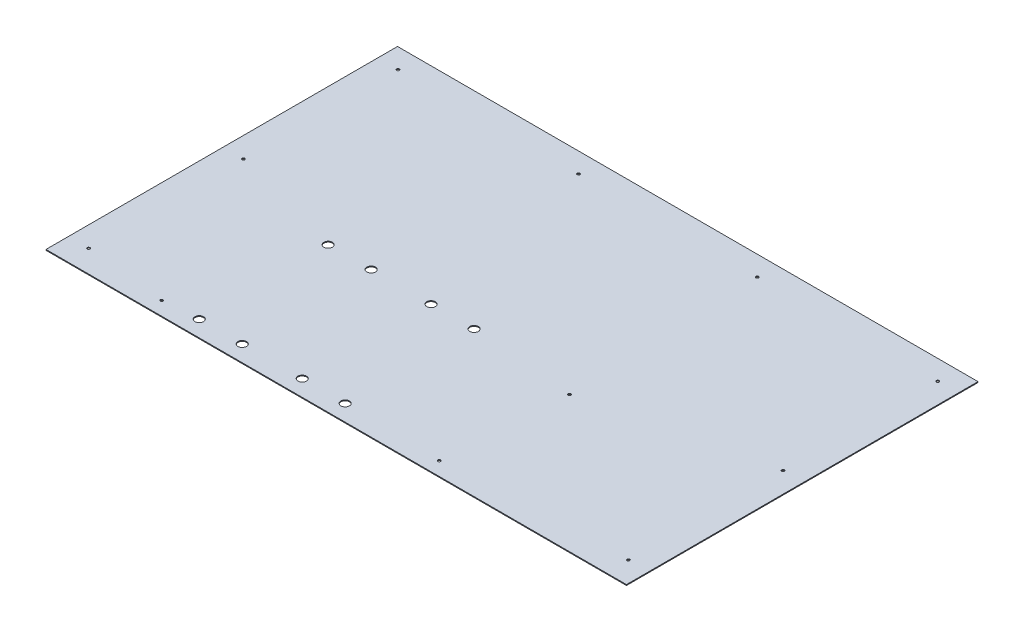
ISO-10303-21;
HEADER;
FILE_DESCRIPTION(('STEP AP214'),'2;1');
FILE_NAME('part.step','',(''),(''),'','','');
FILE_SCHEMA(('AUTOMOTIVE_DESIGN { 1 0 10303 214 1 1 1 1 }'));
ENDSEC;
DATA;
#1=APPLICATION_CONTEXT('core data for automotive mechanical design processes');
#2=APPLICATION_PROTOCOL_DEFINITION('international standard','automotive_design',2000,#1);
#3=PRODUCT_CONTEXT('',#1,'mechanical');
#4=PRODUCT('Part','Part','',(#3));
#5=PRODUCT_RELATED_PRODUCT_CATEGORY('part','',(#4));
#6=PRODUCT_DEFINITION_FORMATION('','',#4);
#7=PRODUCT_DEFINITION_CONTEXT('part definition',#1,'design');
#8=PRODUCT_DEFINITION('design','',#6,#7);
#9=PRODUCT_DEFINITION_SHAPE('','',#8);
#10=(LENGTH_UNIT() NAMED_UNIT(*) SI_UNIT(.MILLI.,.METRE.));
#11=(NAMED_UNIT(*) PLANE_ANGLE_UNIT() SI_UNIT($,.RADIAN.));
#12=(NAMED_UNIT(*) SI_UNIT($,.STERADIAN.) SOLID_ANGLE_UNIT());
#13=UNCERTAINTY_MEASURE_WITH_UNIT(LENGTH_MEASURE(1.E-05),#10,'distance_accuracy_value','');
#14=(GEOMETRIC_REPRESENTATION_CONTEXT(3) GLOBAL_UNCERTAINTY_ASSIGNED_CONTEXT((#13)) GLOBAL_UNIT_ASSIGNED_CONTEXT((#10,
#11,#12)) REPRESENTATION_CONTEXT('',''));
#15=CARTESIAN_POINT('',(0.,0.,0.));
#16=DIRECTION('',(0.,0.,1.));
#17=DIRECTION('',(1.,0.,0.));
#18=AXIS2_PLACEMENT_3D('',#15,#16,#17);
#19=CARTESIAN_POINT('',(337.7,1.,204.5));
#20=DIRECTION('',(-1.,0.,0.));
#21=DIRECTION('',(0.,0.,1.));
#22=AXIS2_PLACEMENT_3D('',#19,#20,#21);
#23=PLANE('',#22);
#24=DIRECTION('',(0.,0.,-1.));
#25=VECTOR('',#24,1.);
#26=CARTESIAN_POINT('',(337.7,0.,204.5));
#27=LINE('',#26,#25);
#28=CARTESIAN_POINT('',(337.7,0.,204.5));
#29=VERTEX_POINT('',#28);
#30=CARTESIAN_POINT('',(337.7,0.,-204.5));
#31=VERTEX_POINT('',#30);
#32=EDGE_CURVE('E95',#29,#31,#27,.T.);
#33=ORIENTED_EDGE('',*,*,#32,.T.);
#34=DIRECTION('',(0.,-1.,0.));
#35=VECTOR('',#34,1.);
#36=CARTESIAN_POINT('',(337.7,1.,-204.5));
#37=LINE('',#36,#35);
#38=CARTESIAN_POINT('',(337.7,1.,-204.5));
#39=VERTEX_POINT('',#38);
#40=EDGE_CURVE('E11',#39,#31,#37,.T.);
#41=ORIENTED_EDGE('',*,*,#40,.F.);
#42=DIRECTION('',(0.,0.,-1.));
#43=VECTOR('',#42,1.);
#44=CARTESIAN_POINT('',(337.7,1.,204.5));
#45=LINE('',#44,#43);
#46=CARTESIAN_POINT('',(337.7,1.,204.5));
#47=VERTEX_POINT('',#46);
#48=EDGE_CURVE('E83',#47,#39,#45,.T.);
#49=ORIENTED_EDGE('',*,*,#48,.F.);
#50=DIRECTION('',(0.,-1.,0.));
#51=VECTOR('',#50,1.);
#52=CARTESIAN_POINT('',(337.7,1.,204.5));
#53=LINE('',#52,#51);
#54=EDGE_CURVE('E91',#47,#29,#53,.T.);
#55=ORIENTED_EDGE('',*,*,#54,.T.);
#56=EDGE_LOOP('',(#33,#41,#49,#55));
#57=FACE_BOUND('',#56,.T.);
#58=ADVANCED_FACE('F32',(#57),#23,.F.);
#59=CARTESIAN_POINT('',(-337.7,1.,-204.5));
#60=DIRECTION('',(0.,0.,1.));
#61=DIRECTION('',(1.,0.,0.));
#62=AXIS2_PLACEMENT_3D('',#59,#60,#61);
#63=PLANE('',#62);
#64=DIRECTION('',(-1.,0.,0.));
#65=VECTOR('',#64,1.);
#66=CARTESIAN_POINT('',(-337.7,0.,-204.5));
#67=LINE('',#66,#65);
#68=CARTESIAN_POINT('',(-337.7,0.,-204.5));
#69=VERTEX_POINT('',#68);
#70=EDGE_CURVE('E87',#31,#69,#67,.T.);
#71=ORIENTED_EDGE('',*,*,#70,.T.);
#72=DIRECTION('',(0.,-1.,0.));
#73=VECTOR('',#72,1.);
#74=CARTESIAN_POINT('',(-337.7,1.,-204.5));
#75=LINE('',#74,#73);
#76=CARTESIAN_POINT('',(-337.7,1.,-204.5));
#77=VERTEX_POINT('',#76);
#78=EDGE_CURVE('E40',#77,#69,#75,.T.);
#79=ORIENTED_EDGE('',*,*,#78,.F.);
#80=DIRECTION('',(-1.,0.,0.));
#81=VECTOR('',#80,1.);
#82=CARTESIAN_POINT('',(-337.7,1.,-204.5));
#83=LINE('',#82,#81);
#84=EDGE_CURVE('E78',#39,#77,#83,.T.);
#85=ORIENTED_EDGE('',*,*,#84,.F.);
#86=ORIENTED_EDGE('',*,*,#40,.T.);
#87=EDGE_LOOP('',(#71,#79,#85,#86));
#88=FACE_BOUND('',#87,.T.);
#89=ADVANCED_FACE('F86',(#88),#63,.F.);
#90=CARTESIAN_POINT('',(-337.7,1.,204.5));
#91=DIRECTION('',(1.,0.,0.));
#92=DIRECTION('',(0.,0.,-1.));
#93=AXIS2_PLACEMENT_3D('',#90,#91,#92);
#94=PLANE('',#93);
#95=DIRECTION('',(0.,0.,1.));
#96=VECTOR('',#95,1.);
#97=CARTESIAN_POINT('',(-337.7,0.,204.5));
#98=LINE('',#97,#96);
#99=CARTESIAN_POINT('',(-337.7,0.,204.5));
#100=VERTEX_POINT('',#99);
#101=EDGE_CURVE('E65',#69,#100,#98,.T.);
#102=ORIENTED_EDGE('',*,*,#101,.T.);
#103=DIRECTION('',(0.,-1.,0.));
#104=VECTOR('',#103,1.);
#105=CARTESIAN_POINT('',(-337.7,1.,204.5));
#106=LINE('',#105,#104);
#107=CARTESIAN_POINT('',(-337.7,1.,204.5));
#108=VERTEX_POINT('',#107);
#109=EDGE_CURVE('E88',#108,#100,#106,.T.);
#110=ORIENTED_EDGE('',*,*,#109,.F.);
#111=DIRECTION('',(0.,0.,1.));
#112=VECTOR('',#111,1.);
#113=CARTESIAN_POINT('',(-337.7,1.,204.5));
#114=LINE('',#113,#112);
#115=EDGE_CURVE('E81',#77,#108,#114,.T.);
#116=ORIENTED_EDGE('',*,*,#115,.F.);
#117=ORIENTED_EDGE('',*,*,#78,.T.);
#118=EDGE_LOOP('',(#102,#110,#116,#117));
#119=FACE_BOUND('',#118,.T.);
#120=ADVANCED_FACE('F89',(#119),#94,.F.);
#121=CARTESIAN_POINT('',(-337.7,1.,204.5));
#122=DIRECTION('',(0.,0.,-1.));
#123=DIRECTION('',(-1.,0.,0.));
#124=AXIS2_PLACEMENT_3D('',#121,#122,#123);
#125=PLANE('',#124);
#126=DIRECTION('',(1.,0.,0.));
#127=VECTOR('',#126,1.);
#128=CARTESIAN_POINT('',(-337.7,0.,204.5));
#129=LINE('',#128,#127);
#130=EDGE_CURVE('E71',#100,#29,#129,.T.);
#131=ORIENTED_EDGE('',*,*,#130,.T.);
#132=ORIENTED_EDGE('',*,*,#54,.F.);
#133=DIRECTION('',(1.,0.,0.));
#134=VECTOR('',#133,1.);
#135=CARTESIAN_POINT('',(-337.7,1.,204.5));
#136=LINE('',#135,#134);
#137=EDGE_CURVE('E48',#108,#47,#136,.T.);
#138=ORIENTED_EDGE('',*,*,#137,.F.);
#139=ORIENTED_EDGE('',*,*,#109,.T.);
#140=EDGE_LOOP('',(#131,#132,#138,#139));
#141=FACE_BOUND('',#140,.T.);
#142=ADVANCED_FACE('F103',(#141),#125,.F.);
#143=CARTESIAN_POINT('',(0.,1.,0.));
#144=DIRECTION('',(0.,-1.,0.));
#145=DIRECTION('',(0.,0.,-1.));
#146=AXIS2_PLACEMENT_3D('',#143,#144,#145);
#147=PLANE('',#146);
#148=CARTESIAN_POINT('',(-104.,1.,-181.4));
#149=DIRECTION('',(0.,-1.,0.));
#150=DIRECTION('',(0.,0.,-1.));
#151=AXIS2_PLACEMENT_3D('',#148,#149,#150);
#152=CIRCLE('',#151,1.59999999999996);
#153=CARTESIAN_POINT('',(-104.,1.,-183.));
#154=VERTEX_POINT('',#153);
#155=EDGE_CURVE('E216',#154,#154,#152,.F.);
#156=ORIENTED_EDGE('',*,*,#155,.F.);
#157=EDGE_LOOP('',(#156));
#158=FACE_BOUND('',#157,.T.);
#159=CARTESIAN_POINT('',(104.,1.,188.6));
#160=DIRECTION('',(0.,-1.,0.));
#161=DIRECTION('',(0.,0.,-1.));
#162=AXIS2_PLACEMENT_3D('',#159,#160,#161);
#163=CIRCLE('',#162,1.60000000000002);
#164=CARTESIAN_POINT('',(104.,1.,187.));
#165=VERTEX_POINT('',#164);
#166=EDGE_CURVE('E210',#165,#165,#163,.F.);
#167=ORIENTED_EDGE('',*,*,#166,.F.);
#168=EDGE_LOOP('',(#167));
#169=FACE_BOUND('',#168,.T.);
#170=CARTESIAN_POINT('',(104.,1.,-181.4));
#171=DIRECTION('',(0.,-1.,0.));
#172=DIRECTION('',(0.,0.,-1.));
#173=AXIS2_PLACEMENT_3D('',#170,#171,#172);
#174=CIRCLE('',#173,1.59999999999999);
#175=CARTESIAN_POINT('',(104.,1.,-183.));
#176=VERTEX_POINT('',#175);
#177=EDGE_CURVE('E204',#176,#176,#174,.F.);
#178=ORIENTED_EDGE('',*,*,#177,.F.);
#179=EDGE_LOOP('',(#178));
#180=FACE_BOUND('',#179,.T.);
#181=CARTESIAN_POINT('',(-219.,1.,188.6));
#182=DIRECTION('',(0.,-1.,0.));
#183=DIRECTION('',(0.,0.,-1.));
#184=AXIS2_PLACEMENT_3D('',#181,#182,#183);
#185=CIRCLE('',#184,1.59999999999999);
#186=CARTESIAN_POINT('',(-219.,1.,187.));
#187=VERTEX_POINT('',#186);
#188=EDGE_CURVE('E198',#187,#187,#185,.F.);
#189=ORIENTED_EDGE('',*,*,#188,.F.);
#190=EDGE_LOOP('',(#189));
#191=FACE_BOUND('',#190,.T.);
#192=CARTESIAN_POINT('',(314.,1.,-1.3999999999999));
#193=DIRECTION('',(0.,-1.,0.));
#194=DIRECTION('',(0.,0.,-1.));
#195=AXIS2_PLACEMENT_3D('',#192,#193,#194);
#196=CIRCLE('',#195,1.59999999999996);
#197=CARTESIAN_POINT('',(314.,1.,-2.99999999999987));
#198=VERTEX_POINT('',#197);
#199=EDGE_CURVE('E192',#198,#198,#196,.F.);
#200=ORIENTED_EDGE('',*,*,#199,.F.);
#201=EDGE_LOOP('',(#200));
#202=FACE_BOUND('',#201,.T.);
#203=CARTESIAN_POINT('',(-314.,1.,-1.40000000000004));
#204=DIRECTION('',(0.,-1.,0.));
#205=DIRECTION('',(0.,0.,-1.));
#206=AXIS2_PLACEMENT_3D('',#203,#204,#205);
#207=CIRCLE('',#206,1.59999999999996);
#208=CARTESIAN_POINT('',(-314.,1.,-3.));
#209=VERTEX_POINT('',#208);
#210=EDGE_CURVE('E186',#209,#209,#207,.F.);
#211=ORIENTED_EDGE('',*,*,#210,.F.);
#212=EDGE_LOOP('',(#211));
#213=FACE_BOUND('',#212,.T.);
#214=CARTESIAN_POINT('',(-128.3,1.,35.6));
#215=DIRECTION('',(0.,-1.,0.));
#216=DIRECTION('',(0.,0.,-1.));
#217=AXIS2_PLACEMENT_3D('',#214,#215,#216);
#218=CIRCLE('',#217,4.99999999999999);
#219=CARTESIAN_POINT('',(-128.3,1.,30.6));
#220=VERTEX_POINT('',#219);
#221=EDGE_CURVE('E180',#220,#220,#218,.F.);
#222=ORIENTED_EDGE('',*,*,#221,.F.);
#223=EDGE_LOOP('',(#222));
#224=FACE_BOUND('',#223,.T.);
#225=CARTESIAN_POINT('',(-178.3,1.,35.6));
#226=DIRECTION('',(0.,-1.,0.));
#227=DIRECTION('',(0.,0.,-1.));
#228=AXIS2_PLACEMENT_3D('',#225,#226,#227);
#229=CIRCLE('',#228,4.99999999999999);
#230=CARTESIAN_POINT('',(-178.3,1.,30.6));
#231=VERTEX_POINT('',#230);
#232=EDGE_CURVE('E174',#231,#231,#229,.F.);
#233=ORIENTED_EDGE('',*,*,#232,.F.);
#234=EDGE_LOOP('',(#233));
#235=FACE_BOUND('',#234,.T.);
#236=CARTESIAN_POINT('',(-178.3,1.,185.6));
#237=DIRECTION('',(0.,-1.,0.));
#238=DIRECTION('',(0.,0.,-1.));
#239=AXIS2_PLACEMENT_3D('',#236,#237,#238);
#240=CIRCLE('',#239,4.99999999999999);
#241=CARTESIAN_POINT('',(-178.3,1.,180.6));
#242=VERTEX_POINT('',#241);
#243=EDGE_CURVE('E168',#242,#242,#240,.F.);
#244=ORIENTED_EDGE('',*,*,#243,.F.);
#245=EDGE_LOOP('',(#244));
#246=FACE_BOUND('',#245,.T.);
#247=CARTESIAN_POINT('',(-128.3,1.,185.6));
#248=DIRECTION('',(0.,-1.,0.));
#249=DIRECTION('',(0.,0.,-1.));
#250=AXIS2_PLACEMENT_3D('',#247,#248,#249);
#251=CIRCLE('',#250,5.00000000000002);
#252=CARTESIAN_POINT('',(-128.3,1.,180.6));
#253=VERTEX_POINT('',#252);
#254=EDGE_CURVE('E162',#253,#253,#251,.F.);
#255=ORIENTED_EDGE('',*,*,#254,.F.);
#256=EDGE_LOOP('',(#255));
#257=FACE_BOUND('',#256,.T.);
#258=CARTESIAN_POINT('',(-58.5,1.,185.6));
#259=DIRECTION('',(0.,-1.,0.));
#260=DIRECTION('',(0.,0.,-1.));
#261=AXIS2_PLACEMENT_3D('',#258,#259,#260);
#262=CIRCLE('',#261,5.00000000000002);
#263=CARTESIAN_POINT('',(-58.5,1.,180.6));
#264=VERTEX_POINT('',#263);
#265=EDGE_CURVE('E156',#264,#264,#262,.F.);
#266=ORIENTED_EDGE('',*,*,#265,.F.);
#267=EDGE_LOOP('',(#266));
#268=FACE_BOUND('',#267,.T.);
#269=CARTESIAN_POINT('',(-8.49999999999999,1.,185.6));
#270=DIRECTION('',(0.,-1.,0.));
#271=DIRECTION('',(0.,0.,-1.));
#272=AXIS2_PLACEMENT_3D('',#269,#270,#271);
#273=CIRCLE('',#272,5.00000000000001);
#274=CARTESIAN_POINT('',(-8.49999999999999,1.,180.6));
#275=VERTEX_POINT('',#274);
#276=EDGE_CURVE('E150',#275,#275,#273,.F.);
#277=ORIENTED_EDGE('',*,*,#276,.F.);
#278=EDGE_LOOP('',(#277));
#279=FACE_BOUND('',#278,.T.);
#280=CARTESIAN_POINT('',(-8.49999999999999,1.,35.6));
#281=DIRECTION('',(0.,-1.,0.));
#282=DIRECTION('',(0.,0.,-1.));
#283=AXIS2_PLACEMENT_3D('',#280,#281,#282);
#284=CIRCLE('',#283,4.99999999999999);
#285=CARTESIAN_POINT('',(-8.49999999999999,1.,30.6));
#286=VERTEX_POINT('',#285);
#287=EDGE_CURVE('E144',#286,#286,#284,.F.);
#288=ORIENTED_EDGE('',*,*,#287,.F.);
#289=EDGE_LOOP('',(#288));
#290=FACE_BOUND('',#289,.T.);
#291=CARTESIAN_POINT('',(-58.5,1.,35.6));
#292=DIRECTION('',(0.,-1.,0.));
#293=DIRECTION('',(0.,0.,-1.));
#294=AXIS2_PLACEMENT_3D('',#291,#292,#293);
#295=CIRCLE('',#294,4.99999999999999);
#296=CARTESIAN_POINT('',(-58.5,1.,30.6));
#297=VERTEX_POINT('',#296);
#298=EDGE_CURVE('E138',#297,#297,#295,.F.);
#299=ORIENTED_EDGE('',*,*,#298,.F.);
#300=EDGE_LOOP('',(#299));
#301=FACE_BOUND('',#300,.T.);
#302=CARTESIAN_POINT('',(113.,1.,46.25));
#303=DIRECTION('',(0.,-1.,0.));
#304=DIRECTION('',(0.,0.,-1.));
#305=AXIS2_PLACEMENT_3D('',#302,#303,#304);
#306=CIRCLE('',#305,1.60000000000001);
#307=CARTESIAN_POINT('',(113.,1.,44.65));
#308=VERTEX_POINT('',#307);
#309=EDGE_CURVE('E132',#308,#308,#306,.F.);
#310=ORIENTED_EDGE('',*,*,#309,.F.);
#311=EDGE_LOOP('',(#310));
#312=FACE_BOUND('',#311,.T.);
#313=CARTESIAN_POINT('',(314.,1.,178.6));
#314=DIRECTION('',(0.,-1.,0.));
#315=DIRECTION('',(0.,0.,-1.));
#316=AXIS2_PLACEMENT_3D('',#313,#314,#315);
#317=CIRCLE('',#316,1.59999999999996);
#318=CARTESIAN_POINT('',(314.,1.,177.));
#319=VERTEX_POINT('',#318);
#320=EDGE_CURVE('E126',#319,#319,#317,.F.);
#321=ORIENTED_EDGE('',*,*,#320,.F.);
#322=EDGE_LOOP('',(#321));
#323=FACE_BOUND('',#322,.T.);
#324=CARTESIAN_POINT('',(314.,1.,-181.4));
#325=DIRECTION('',(0.,-1.,0.));
#326=DIRECTION('',(0.,0.,-1.));
#327=AXIS2_PLACEMENT_3D('',#324,#325,#326);
#328=CIRCLE('',#327,1.59999999999996);
#329=CARTESIAN_POINT('',(314.,1.,-183.));
#330=VERTEX_POINT('',#329);
#331=EDGE_CURVE('E120',#330,#330,#328,.F.);
#332=ORIENTED_EDGE('',*,*,#331,.F.);
#333=EDGE_LOOP('',(#332));
#334=FACE_BOUND('',#333,.T.);
#335=CARTESIAN_POINT('',(-314.,1.,-181.4));
#336=DIRECTION('',(0.,-1.,0.));
#337=DIRECTION('',(0.,0.,-1.));
#338=AXIS2_PLACEMENT_3D('',#335,#336,#337);
#339=CIRCLE('',#338,1.59999999999996);
#340=CARTESIAN_POINT('',(-314.,1.,-183.));
#341=VERTEX_POINT('',#340);
#342=EDGE_CURVE('E114',#341,#341,#339,.F.);
#343=ORIENTED_EDGE('',*,*,#342,.F.);
#344=EDGE_LOOP('',(#343));
#345=FACE_BOUND('',#344,.T.);
#346=CARTESIAN_POINT('',(-314.,1.,178.6));
#347=DIRECTION('',(0.,-1.,0.));
#348=DIRECTION('',(0.,0.,-1.));
#349=AXIS2_PLACEMENT_3D('',#346,#347,#348);
#350=CIRCLE('',#349,1.59999999999996);
#351=CARTESIAN_POINT('',(-314.,1.,177.));
#352=VERTEX_POINT('',#351);
#353=EDGE_CURVE('E98',#352,#352,#350,.F.);
#354=ORIENTED_EDGE('',*,*,#353,.F.);
#355=EDGE_LOOP('',(#354));
#356=FACE_BOUND('',#355,.T.);
#357=ORIENTED_EDGE('',*,*,#48,.T.);
#358=ORIENTED_EDGE('',*,*,#84,.T.);
#359=ORIENTED_EDGE('',*,*,#115,.T.);
#360=ORIENTED_EDGE('',*,*,#137,.T.);
#361=EDGE_LOOP('',(#357,#358,#359,#360));
#362=FACE_BOUND('',#361,.T.);
#363=ADVANCED_FACE('F79',(#158,#169,#180,#191,#202,#213,#224,#235,#246,#257,#268,#279,#290,#301,
#312,#323,#334,#345,#356,#362),#147,.F.);
#364=CARTESIAN_POINT('',(0.,0.,0.));
#365=DIRECTION('',(0.,-1.,0.));
#366=DIRECTION('',(0.,0.,-1.));
#367=AXIS2_PLACEMENT_3D('',#364,#365,#366);
#368=PLANE('',#367);
#369=CARTESIAN_POINT('',(-104.,0.,-181.4));
#370=DIRECTION('',(0.,-1.,0.));
#371=DIRECTION('',(0.,0.,-1.));
#372=AXIS2_PLACEMENT_3D('',#369,#370,#371);
#373=CIRCLE('',#372,1.59999999999996);
#374=CARTESIAN_POINT('',(-104.,0.,-183.));
#375=VERTEX_POINT('',#374);
#376=EDGE_CURVE('E219',#375,#375,#373,.T.);
#377=ORIENTED_EDGE('',*,*,#376,.F.);
#378=EDGE_LOOP('',(#377));
#379=FACE_BOUND('',#378,.T.);
#380=CARTESIAN_POINT('',(104.,0.,188.6));
#381=DIRECTION('',(0.,-1.,0.));
#382=DIRECTION('',(0.,0.,-1.));
#383=AXIS2_PLACEMENT_3D('',#380,#381,#382);
#384=CIRCLE('',#383,1.60000000000002);
#385=CARTESIAN_POINT('',(104.,0.,187.));
#386=VERTEX_POINT('',#385);
#387=EDGE_CURVE('E213',#386,#386,#384,.T.);
#388=ORIENTED_EDGE('',*,*,#387,.F.);
#389=EDGE_LOOP('',(#388));
#390=FACE_BOUND('',#389,.T.);
#391=CARTESIAN_POINT('',(104.,0.,-181.4));
#392=DIRECTION('',(0.,-1.,0.));
#393=DIRECTION('',(0.,0.,-1.));
#394=AXIS2_PLACEMENT_3D('',#391,#392,#393);
#395=CIRCLE('',#394,1.59999999999999);
#396=CARTESIAN_POINT('',(104.,0.,-183.));
#397=VERTEX_POINT('',#396);
#398=EDGE_CURVE('E207',#397,#397,#395,.T.);
#399=ORIENTED_EDGE('',*,*,#398,.F.);
#400=EDGE_LOOP('',(#399));
#401=FACE_BOUND('',#400,.T.);
#402=CARTESIAN_POINT('',(-219.,0.,188.6));
#403=DIRECTION('',(0.,-1.,0.));
#404=DIRECTION('',(0.,0.,-1.));
#405=AXIS2_PLACEMENT_3D('',#402,#403,#404);
#406=CIRCLE('',#405,1.59999999999999);
#407=CARTESIAN_POINT('',(-219.,0.,187.));
#408=VERTEX_POINT('',#407);
#409=EDGE_CURVE('E201',#408,#408,#406,.T.);
#410=ORIENTED_EDGE('',*,*,#409,.F.);
#411=EDGE_LOOP('',(#410));
#412=FACE_BOUND('',#411,.T.);
#413=CARTESIAN_POINT('',(314.,0.,-1.3999999999999));
#414=DIRECTION('',(0.,-1.,0.));
#415=DIRECTION('',(0.,0.,-1.));
#416=AXIS2_PLACEMENT_3D('',#413,#414,#415);
#417=CIRCLE('',#416,1.59999999999996);
#418=CARTESIAN_POINT('',(314.,0.,-2.99999999999987));
#419=VERTEX_POINT('',#418);
#420=EDGE_CURVE('E195',#419,#419,#417,.T.);
#421=ORIENTED_EDGE('',*,*,#420,.F.);
#422=EDGE_LOOP('',(#421));
#423=FACE_BOUND('',#422,.T.);
#424=CARTESIAN_POINT('',(-314.,0.,-1.40000000000004));
#425=DIRECTION('',(0.,-1.,0.));
#426=DIRECTION('',(0.,0.,-1.));
#427=AXIS2_PLACEMENT_3D('',#424,#425,#426);
#428=CIRCLE('',#427,1.59999999999996);
#429=CARTESIAN_POINT('',(-314.,0.,-3.));
#430=VERTEX_POINT('',#429);
#431=EDGE_CURVE('E189',#430,#430,#428,.T.);
#432=ORIENTED_EDGE('',*,*,#431,.F.);
#433=EDGE_LOOP('',(#432));
#434=FACE_BOUND('',#433,.T.);
#435=CARTESIAN_POINT('',(-128.3,0.,35.6));
#436=DIRECTION('',(0.,-1.,0.));
#437=DIRECTION('',(0.,0.,1.));
#438=AXIS2_PLACEMENT_3D('',#435,#436,#437);
#439=CIRCLE('',#438,4.99999999999999);
#440=CARTESIAN_POINT('',(-128.3,0.,40.6));
#441=VERTEX_POINT('',#440);
#442=EDGE_CURVE('E183',#441,#441,#439,.T.);
#443=ORIENTED_EDGE('',*,*,#442,.F.);
#444=EDGE_LOOP('',(#443));
#445=FACE_BOUND('',#444,.T.);
#446=CARTESIAN_POINT('',(-178.3,0.,35.6));
#447=DIRECTION('',(0.,-1.,0.));
#448=DIRECTION('',(0.,0.,1.));
#449=AXIS2_PLACEMENT_3D('',#446,#447,#448);
#450=CIRCLE('',#449,4.99999999999999);
#451=CARTESIAN_POINT('',(-178.3,0.,40.6));
#452=VERTEX_POINT('',#451);
#453=EDGE_CURVE('E177',#452,#452,#450,.T.);
#454=ORIENTED_EDGE('',*,*,#453,.F.);
#455=EDGE_LOOP('',(#454));
#456=FACE_BOUND('',#455,.T.);
#457=CARTESIAN_POINT('',(-178.3,0.,185.6));
#458=DIRECTION('',(0.,-1.,0.));
#459=DIRECTION('',(0.,0.,1.));
#460=AXIS2_PLACEMENT_3D('',#457,#458,#459);
#461=CIRCLE('',#460,4.99999999999999);
#462=CARTESIAN_POINT('',(-178.3,0.,190.6));
#463=VERTEX_POINT('',#462);
#464=EDGE_CURVE('E171',#463,#463,#461,.T.);
#465=ORIENTED_EDGE('',*,*,#464,.F.);
#466=EDGE_LOOP('',(#465));
#467=FACE_BOUND('',#466,.T.);
#468=CARTESIAN_POINT('',(-128.3,0.,185.6));
#469=DIRECTION('',(0.,-1.,0.));
#470=DIRECTION('',(0.,0.,1.));
#471=AXIS2_PLACEMENT_3D('',#468,#469,#470);
#472=CIRCLE('',#471,5.00000000000002);
#473=CARTESIAN_POINT('',(-128.3,0.,190.6));
#474=VERTEX_POINT('',#473);
#475=EDGE_CURVE('E165',#474,#474,#472,.T.);
#476=ORIENTED_EDGE('',*,*,#475,.F.);
#477=EDGE_LOOP('',(#476));
#478=FACE_BOUND('',#477,.T.);
#479=CARTESIAN_POINT('',(-58.5,0.,185.6));
#480=DIRECTION('',(0.,-1.,0.));
#481=DIRECTION('',(0.,0.,-1.));
#482=AXIS2_PLACEMENT_3D('',#479,#480,#481);
#483=CIRCLE('',#482,5.00000000000002);
#484=CARTESIAN_POINT('',(-58.5,0.,180.6));
#485=VERTEX_POINT('',#484);
#486=EDGE_CURVE('E159',#485,#485,#483,.T.);
#487=ORIENTED_EDGE('',*,*,#486,.F.);
#488=EDGE_LOOP('',(#487));
#489=FACE_BOUND('',#488,.T.);
#490=CARTESIAN_POINT('',(-8.49999999999999,0.,185.6));
#491=DIRECTION('',(0.,-1.,0.));
#492=DIRECTION('',(0.,0.,-1.));
#493=AXIS2_PLACEMENT_3D('',#490,#491,#492);
#494=CIRCLE('',#493,5.00000000000001);
#495=CARTESIAN_POINT('',(-8.49999999999999,0.,180.6));
#496=VERTEX_POINT('',#495);
#497=EDGE_CURVE('E153',#496,#496,#494,.T.);
#498=ORIENTED_EDGE('',*,*,#497,.F.);
#499=EDGE_LOOP('',(#498));
#500=FACE_BOUND('',#499,.T.);
#501=CARTESIAN_POINT('',(-8.49999999999999,0.,35.6));
#502=DIRECTION('',(0.,-1.,0.));
#503=DIRECTION('',(0.,0.,-1.));
#504=AXIS2_PLACEMENT_3D('',#501,#502,#503);
#505=CIRCLE('',#504,4.99999999999999);
#506=CARTESIAN_POINT('',(-8.49999999999999,0.,30.6));
#507=VERTEX_POINT('',#506);
#508=EDGE_CURVE('E147',#507,#507,#505,.T.);
#509=ORIENTED_EDGE('',*,*,#508,.F.);
#510=EDGE_LOOP('',(#509));
#511=FACE_BOUND('',#510,.T.);
#512=CARTESIAN_POINT('',(-58.5,0.,35.6));
#513=DIRECTION('',(0.,-1.,0.));
#514=DIRECTION('',(0.,0.,-1.));
#515=AXIS2_PLACEMENT_3D('',#512,#513,#514);
#516=CIRCLE('',#515,4.99999999999999);
#517=CARTESIAN_POINT('',(-58.5,0.,30.6));
#518=VERTEX_POINT('',#517);
#519=EDGE_CURVE('E141',#518,#518,#516,.T.);
#520=ORIENTED_EDGE('',*,*,#519,.F.);
#521=EDGE_LOOP('',(#520));
#522=FACE_BOUND('',#521,.T.);
#523=CARTESIAN_POINT('',(113.,0.,46.25));
#524=DIRECTION('',(0.,-1.,0.));
#525=DIRECTION('',(0.,0.,-1.));
#526=AXIS2_PLACEMENT_3D('',#523,#524,#525);
#527=CIRCLE('',#526,1.60000000000001);
#528=CARTESIAN_POINT('',(113.,0.,44.65));
#529=VERTEX_POINT('',#528);
#530=EDGE_CURVE('E135',#529,#529,#527,.T.);
#531=ORIENTED_EDGE('',*,*,#530,.F.);
#532=EDGE_LOOP('',(#531));
#533=FACE_BOUND('',#532,.T.);
#534=CARTESIAN_POINT('',(314.,0.,178.6));
#535=DIRECTION('',(0.,-1.,0.));
#536=DIRECTION('',(0.,0.,-1.));
#537=AXIS2_PLACEMENT_3D('',#534,#535,#536);
#538=CIRCLE('',#537,1.59999999999996);
#539=CARTESIAN_POINT('',(314.,0.,177.));
#540=VERTEX_POINT('',#539);
#541=EDGE_CURVE('E129',#540,#540,#538,.T.);
#542=ORIENTED_EDGE('',*,*,#541,.F.);
#543=EDGE_LOOP('',(#542));
#544=FACE_BOUND('',#543,.T.);
#545=CARTESIAN_POINT('',(314.,0.,-181.4));
#546=DIRECTION('',(0.,-1.,0.));
#547=DIRECTION('',(0.,0.,-1.));
#548=AXIS2_PLACEMENT_3D('',#545,#546,#547);
#549=CIRCLE('',#548,1.59999999999996);
#550=CARTESIAN_POINT('',(314.,0.,-183.));
#551=VERTEX_POINT('',#550);
#552=EDGE_CURVE('E123',#551,#551,#549,.T.);
#553=ORIENTED_EDGE('',*,*,#552,.F.);
#554=EDGE_LOOP('',(#553));
#555=FACE_BOUND('',#554,.T.);
#556=CARTESIAN_POINT('',(-314.,0.,-181.4));
#557=DIRECTION('',(0.,-1.,0.));
#558=DIRECTION('',(0.,0.,-1.));
#559=AXIS2_PLACEMENT_3D('',#556,#557,#558);
#560=CIRCLE('',#559,1.59999999999996);
#561=CARTESIAN_POINT('',(-314.,0.,-183.));
#562=VERTEX_POINT('',#561);
#563=EDGE_CURVE('E117',#562,#562,#560,.T.);
#564=ORIENTED_EDGE('',*,*,#563,.F.);
#565=EDGE_LOOP('',(#564));
#566=FACE_BOUND('',#565,.T.);
#567=CARTESIAN_POINT('',(-314.,0.,178.6));
#568=DIRECTION('',(0.,-1.,0.));
#569=DIRECTION('',(0.,0.,-1.));
#570=AXIS2_PLACEMENT_3D('',#567,#568,#569);
#571=CIRCLE('',#570,1.59999999999996);
#572=CARTESIAN_POINT('',(-314.,0.,177.));
#573=VERTEX_POINT('',#572);
#574=EDGE_CURVE('E111',#573,#573,#571,.T.);
#575=ORIENTED_EDGE('',*,*,#574,.F.);
#576=EDGE_LOOP('',(#575));
#577=FACE_BOUND('',#576,.T.);
#578=ORIENTED_EDGE('',*,*,#32,.F.);
#579=ORIENTED_EDGE('',*,*,#130,.F.);
#580=ORIENTED_EDGE('',*,*,#101,.F.);
#581=ORIENTED_EDGE('',*,*,#70,.F.);
#582=EDGE_LOOP('',(#578,#579,#580,#581));
#583=FACE_BOUND('',#582,.T.);
#584=ADVANCED_FACE('F106',(#379,#390,#401,#412,#423,#434,#445,#456,#467,#478,#489,#500,#511,
#522,#533,#544,#555,#566,#577,#583),#368,.T.);
#585=CARTESIAN_POINT('',(-314.,1.001,178.6));
#586=DIRECTION('',(0.,-1.,0.));
#587=DIRECTION('',(0.,0.,-1.));
#588=AXIS2_PLACEMENT_3D('',#585,#586,#587);
#589=CYLINDRICAL_SURFACE('',#588,1.59999999999996);
#590=ORIENTED_EDGE('',*,*,#574,.T.);
#591=EDGE_LOOP('',(#590));
#592=FACE_BOUND('',#591,.T.);
#593=ORIENTED_EDGE('',*,*,#353,.T.);
#594=EDGE_LOOP('',(#593));
#595=FACE_BOUND('',#594,.T.);
#596=ADVANCED_FACE('F228',(#592,#595),#589,.F.);
#597=CARTESIAN_POINT('',(-314.,1.001,-181.4));
#598=DIRECTION('',(0.,-1.,0.));
#599=DIRECTION('',(0.,0.,-1.));
#600=AXIS2_PLACEMENT_3D('',#597,#598,#599);
#601=CYLINDRICAL_SURFACE('',#600,1.59999999999996);
#602=ORIENTED_EDGE('',*,*,#563,.T.);
#603=EDGE_LOOP('',(#602));
#604=FACE_BOUND('',#603,.T.);
#605=ORIENTED_EDGE('',*,*,#342,.T.);
#606=EDGE_LOOP('',(#605));
#607=FACE_BOUND('',#606,.T.);
#608=ADVANCED_FACE('F268',(#604,#607),#601,.F.);
#609=CARTESIAN_POINT('',(314.,1.001,-181.4));
#610=DIRECTION('',(0.,-1.,0.));
#611=DIRECTION('',(0.,0.,-1.));
#612=AXIS2_PLACEMENT_3D('',#609,#610,#611);
#613=CYLINDRICAL_SURFACE('',#612,1.59999999999996);
#614=ORIENTED_EDGE('',*,*,#552,.T.);
#615=EDGE_LOOP('',(#614));
#616=FACE_BOUND('',#615,.T.);
#617=ORIENTED_EDGE('',*,*,#331,.T.);
#618=EDGE_LOOP('',(#617));
#619=FACE_BOUND('',#618,.T.);
#620=ADVANCED_FACE('F312',(#616,#619),#613,.F.);
#621=CARTESIAN_POINT('',(314.,1.001,178.6));
#622=DIRECTION('',(0.,-1.,0.));
#623=DIRECTION('',(0.,0.,-1.));
#624=AXIS2_PLACEMENT_3D('',#621,#622,#623);
#625=CYLINDRICAL_SURFACE('',#624,1.59999999999996);
#626=ORIENTED_EDGE('',*,*,#541,.T.);
#627=EDGE_LOOP('',(#626));
#628=FACE_BOUND('',#627,.T.);
#629=ORIENTED_EDGE('',*,*,#320,.T.);
#630=EDGE_LOOP('',(#629));
#631=FACE_BOUND('',#630,.T.);
#632=ADVANCED_FACE('F322',(#628,#631),#625,.F.);
#633=CARTESIAN_POINT('',(113.,1.001,46.25));
#634=DIRECTION('',(0.,-1.,0.));
#635=DIRECTION('',(0.,0.,-1.));
#636=AXIS2_PLACEMENT_3D('',#633,#634,#635);
#637=CYLINDRICAL_SURFACE('',#636,1.60000000000001);
#638=ORIENTED_EDGE('',*,*,#530,.T.);
#639=EDGE_LOOP('',(#638));
#640=FACE_BOUND('',#639,.T.);
#641=ORIENTED_EDGE('',*,*,#309,.T.);
#642=EDGE_LOOP('',(#641));
#643=FACE_BOUND('',#642,.T.);
#644=ADVANCED_FACE('F332',(#640,#643),#637,.F.);
#645=CARTESIAN_POINT('',(-58.5,1.001,35.6));
#646=DIRECTION('',(0.,-1.,0.));
#647=DIRECTION('',(0.,0.,-1.));
#648=AXIS2_PLACEMENT_3D('',#645,#646,#647);
#649=CYLINDRICAL_SURFACE('',#648,4.99999999999999);
#650=ORIENTED_EDGE('',*,*,#519,.T.);
#651=EDGE_LOOP('',(#650));
#652=FACE_BOUND('',#651,.T.);
#653=ORIENTED_EDGE('',*,*,#298,.T.);
#654=EDGE_LOOP('',(#653));
#655=FACE_BOUND('',#654,.T.);
#656=ADVANCED_FACE('F342',(#652,#655),#649,.F.);
#657=CARTESIAN_POINT('',(-8.49999999999999,1.001,35.6));
#658=DIRECTION('',(0.,-1.,0.));
#659=DIRECTION('',(0.,0.,-1.));
#660=AXIS2_PLACEMENT_3D('',#657,#658,#659);
#661=CYLINDRICAL_SURFACE('',#660,4.99999999999999);
#662=ORIENTED_EDGE('',*,*,#508,.T.);
#663=EDGE_LOOP('',(#662));
#664=FACE_BOUND('',#663,.T.);
#665=ORIENTED_EDGE('',*,*,#287,.T.);
#666=EDGE_LOOP('',(#665));
#667=FACE_BOUND('',#666,.T.);
#668=ADVANCED_FACE('F352',(#664,#667),#661,.F.);
#669=CARTESIAN_POINT('',(-8.49999999999999,1.001,185.6));
#670=DIRECTION('',(0.,-1.,0.));
#671=DIRECTION('',(0.,0.,-1.));
#672=AXIS2_PLACEMENT_3D('',#669,#670,#671);
#673=CYLINDRICAL_SURFACE('',#672,5.00000000000001);
#674=ORIENTED_EDGE('',*,*,#497,.T.);
#675=EDGE_LOOP('',(#674));
#676=FACE_BOUND('',#675,.T.);
#677=ORIENTED_EDGE('',*,*,#276,.T.);
#678=EDGE_LOOP('',(#677));
#679=FACE_BOUND('',#678,.T.);
#680=ADVANCED_FACE('F362',(#676,#679),#673,.F.);
#681=CARTESIAN_POINT('',(-58.5,1.001,185.6));
#682=DIRECTION('',(0.,-1.,0.));
#683=DIRECTION('',(0.,0.,-1.));
#684=AXIS2_PLACEMENT_3D('',#681,#682,#683);
#685=CYLINDRICAL_SURFACE('',#684,5.00000000000002);
#686=ORIENTED_EDGE('',*,*,#486,.T.);
#687=EDGE_LOOP('',(#686));
#688=FACE_BOUND('',#687,.T.);
#689=ORIENTED_EDGE('',*,*,#265,.T.);
#690=EDGE_LOOP('',(#689));
#691=FACE_BOUND('',#690,.T.);
#692=ADVANCED_FACE('F372',(#688,#691),#685,.F.);
#693=CARTESIAN_POINT('',(-128.3,1.001,185.6));
#694=DIRECTION('',(0.,-1.,0.));
#695=DIRECTION('',(0.,0.,-1.));
#696=AXIS2_PLACEMENT_3D('',#693,#694,#695);
#697=CYLINDRICAL_SURFACE('',#696,5.00000000000002);
#698=ORIENTED_EDGE('',*,*,#475,.T.);
#699=EDGE_LOOP('',(#698));
#700=FACE_BOUND('',#699,.T.);
#701=ORIENTED_EDGE('',*,*,#254,.T.);
#702=EDGE_LOOP('',(#701));
#703=FACE_BOUND('',#702,.T.);
#704=ADVANCED_FACE('F382',(#700,#703),#697,.F.);
#705=CARTESIAN_POINT('',(-178.3,1.001,185.6));
#706=DIRECTION('',(0.,-1.,0.));
#707=DIRECTION('',(0.,0.,-1.));
#708=AXIS2_PLACEMENT_3D('',#705,#706,#707);
#709=CYLINDRICAL_SURFACE('',#708,4.99999999999999);
#710=ORIENTED_EDGE('',*,*,#464,.T.);
#711=EDGE_LOOP('',(#710));
#712=FACE_BOUND('',#711,.T.);
#713=ORIENTED_EDGE('',*,*,#243,.T.);
#714=EDGE_LOOP('',(#713));
#715=FACE_BOUND('',#714,.T.);
#716=ADVANCED_FACE('F392',(#712,#715),#709,.F.);
#717=CARTESIAN_POINT('',(-178.3,1.001,35.6));
#718=DIRECTION('',(0.,-1.,0.));
#719=DIRECTION('',(0.,0.,-1.));
#720=AXIS2_PLACEMENT_3D('',#717,#718,#719);
#721=CYLINDRICAL_SURFACE('',#720,4.99999999999999);
#722=ORIENTED_EDGE('',*,*,#453,.T.);
#723=EDGE_LOOP('',(#722));
#724=FACE_BOUND('',#723,.T.);
#725=ORIENTED_EDGE('',*,*,#232,.T.);
#726=EDGE_LOOP('',(#725));
#727=FACE_BOUND('',#726,.T.);
#728=ADVANCED_FACE('F402',(#724,#727),#721,.F.);
#729=CARTESIAN_POINT('',(-128.3,1.001,35.6));
#730=DIRECTION('',(0.,-1.,0.));
#731=DIRECTION('',(0.,0.,-1.));
#732=AXIS2_PLACEMENT_3D('',#729,#730,#731);
#733=CYLINDRICAL_SURFACE('',#732,4.99999999999999);
#734=ORIENTED_EDGE('',*,*,#442,.T.);
#735=EDGE_LOOP('',(#734));
#736=FACE_BOUND('',#735,.T.);
#737=ORIENTED_EDGE('',*,*,#221,.T.);
#738=EDGE_LOOP('',(#737));
#739=FACE_BOUND('',#738,.T.);
#740=ADVANCED_FACE('F412',(#736,#739),#733,.F.);
#741=CARTESIAN_POINT('',(-314.,1.001,-1.40000000000004));
#742=DIRECTION('',(0.,-1.,0.));
#743=DIRECTION('',(0.,0.,-1.));
#744=AXIS2_PLACEMENT_3D('',#741,#742,#743);
#745=CYLINDRICAL_SURFACE('',#744,1.59999999999996);
#746=ORIENTED_EDGE('',*,*,#431,.T.);
#747=EDGE_LOOP('',(#746));
#748=FACE_BOUND('',#747,.T.);
#749=ORIENTED_EDGE('',*,*,#210,.T.);
#750=EDGE_LOOP('',(#749));
#751=FACE_BOUND('',#750,.T.);
#752=ADVANCED_FACE('F421',(#748,#751),#745,.F.);
#753=CARTESIAN_POINT('',(314.,1.001,-1.3999999999999));
#754=DIRECTION('',(0.,-1.,0.));
#755=DIRECTION('',(0.,0.,-1.));
#756=AXIS2_PLACEMENT_3D('',#753,#754,#755);
#757=CYLINDRICAL_SURFACE('',#756,1.59999999999996);
#758=ORIENTED_EDGE('',*,*,#420,.T.);
#759=EDGE_LOOP('',(#758));
#760=FACE_BOUND('',#759,.T.);
#761=ORIENTED_EDGE('',*,*,#199,.T.);
#762=EDGE_LOOP('',(#761));
#763=FACE_BOUND('',#762,.T.);
#764=ADVANCED_FACE('F440',(#760,#763),#757,.F.);
#765=CARTESIAN_POINT('',(-219.,1.001,188.6));
#766=DIRECTION('',(0.,-1.,0.));
#767=DIRECTION('',(0.,0.,-1.));
#768=AXIS2_PLACEMENT_3D('',#765,#766,#767);
#769=CYLINDRICAL_SURFACE('',#768,1.59999999999999);
#770=ORIENTED_EDGE('',*,*,#409,.T.);
#771=EDGE_LOOP('',(#770));
#772=FACE_BOUND('',#771,.T.);
#773=ORIENTED_EDGE('',*,*,#188,.T.);
#774=EDGE_LOOP('',(#773));
#775=FACE_BOUND('',#774,.T.);
#776=ADVANCED_FACE('F450',(#772,#775),#769,.F.);
#777=CARTESIAN_POINT('',(104.,1.001,-181.4));
#778=DIRECTION('',(0.,-1.,0.));
#779=DIRECTION('',(0.,0.,-1.));
#780=AXIS2_PLACEMENT_3D('',#777,#778,#779);
#781=CYLINDRICAL_SURFACE('',#780,1.59999999999999);
#782=ORIENTED_EDGE('',*,*,#398,.T.);
#783=EDGE_LOOP('',(#782));
#784=FACE_BOUND('',#783,.T.);
#785=ORIENTED_EDGE('',*,*,#177,.T.);
#786=EDGE_LOOP('',(#785));
#787=FACE_BOUND('',#786,.T.);
#788=ADVANCED_FACE('F460',(#784,#787),#781,.F.);
#789=CARTESIAN_POINT('',(104.,1.001,188.6));
#790=DIRECTION('',(0.,-1.,0.));
#791=DIRECTION('',(0.,0.,-1.));
#792=AXIS2_PLACEMENT_3D('',#789,#790,#791);
#793=CYLINDRICAL_SURFACE('',#792,1.60000000000002);
#794=ORIENTED_EDGE('',*,*,#387,.T.);
#795=EDGE_LOOP('',(#794));
#796=FACE_BOUND('',#795,.T.);
#797=ORIENTED_EDGE('',*,*,#166,.T.);
#798=EDGE_LOOP('',(#797));
#799=FACE_BOUND('',#798,.T.);
#800=ADVANCED_FACE('F470',(#796,#799),#793,.F.);
#801=CARTESIAN_POINT('',(-104.,1.001,-181.4));
#802=DIRECTION('',(0.,-1.,0.));
#803=DIRECTION('',(0.,0.,-1.));
#804=AXIS2_PLACEMENT_3D('',#801,#802,#803);
#805=CYLINDRICAL_SURFACE('',#804,1.59999999999996);
#806=ORIENTED_EDGE('',*,*,#376,.T.);
#807=EDGE_LOOP('',(#806));
#808=FACE_BOUND('',#807,.T.);
#809=ORIENTED_EDGE('',*,*,#155,.T.);
#810=EDGE_LOOP('',(#809));
#811=FACE_BOUND('',#810,.T.);
#812=ADVANCED_FACE('F223',(#808,#811),#805,.F.);
#813=CLOSED_SHELL('',(#58,#89,#120,#142,#363,#584,#596,#608,#620,#632,#644,#656,#668,#680,#692,
#704,#716,#728,#740,#752,#764,#776,#788,#800,#812));
#814=MANIFOLD_SOLID_BREP('B2',#813);
#815=ADVANCED_BREP_SHAPE_REPRESENTATION('',(#18,#814),#14);
#816=SHAPE_DEFINITION_REPRESENTATION(#9,#815);
ENDSEC;
END-ISO-10303-21;
